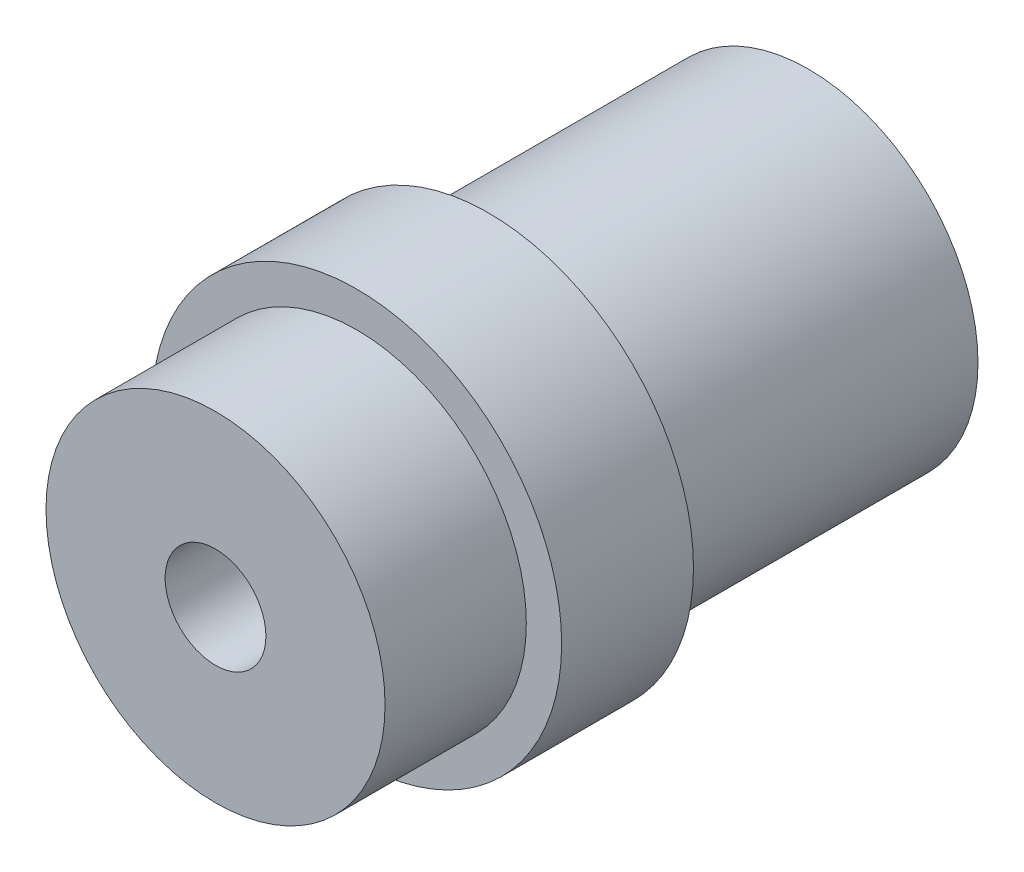
ISO-10303-21;
HEADER;
FILE_DESCRIPTION(('STEP AP214'),'2;1');
FILE_NAME('part.step','',(''),(''),'','','');
FILE_SCHEMA(('AUTOMOTIVE_DESIGN { 1 0 10303 214 1 1 1 1 }'));
ENDSEC;
DATA;
#1=APPLICATION_CONTEXT('core data for automotive mechanical design processes');
#2=APPLICATION_PROTOCOL_DEFINITION('international standard','automotive_design',2000,#1);
#3=PRODUCT_CONTEXT('',#1,'mechanical');
#4=PRODUCT('Part','Part','',(#3));
#5=PRODUCT_RELATED_PRODUCT_CATEGORY('part','',(#4));
#6=PRODUCT_DEFINITION_FORMATION('','',#4);
#7=PRODUCT_DEFINITION_CONTEXT('part definition',#1,'design');
#8=PRODUCT_DEFINITION('design','',#6,#7);
#9=PRODUCT_DEFINITION_SHAPE('','',#8);
#10=(LENGTH_UNIT() NAMED_UNIT(*) SI_UNIT(.MILLI.,.METRE.));
#11=(NAMED_UNIT(*) PLANE_ANGLE_UNIT() SI_UNIT($,.RADIAN.));
#12=(NAMED_UNIT(*) SI_UNIT($,.STERADIAN.) SOLID_ANGLE_UNIT());
#13=UNCERTAINTY_MEASURE_WITH_UNIT(LENGTH_MEASURE(1.E-05),#10,'distance_accuracy_value','');
#14=(GEOMETRIC_REPRESENTATION_CONTEXT(3) GLOBAL_UNCERTAINTY_ASSIGNED_CONTEXT((#13)) GLOBAL_UNIT_ASSIGNED_CONTEXT((#10,
#11,#12)) REPRESENTATION_CONTEXT('',''));
#15=CARTESIAN_POINT('',(0.,0.,0.));
#16=DIRECTION('',(0.,0.,1.));
#17=DIRECTION('',(1.,0.,0.));
#18=AXIS2_PLACEMENT_3D('',#15,#16,#17);
#19=CARTESIAN_POINT('',(0.,0.,0.));
#20=DIRECTION('',(0.,0.,1.));
#21=DIRECTION('',(1.,0.,0.));
#22=AXIS2_PLACEMENT_3D('',#19,#20,#21);
#23=PLANE('',#22);
#24=CARTESIAN_POINT('',(0.,0.,0.));
#25=DIRECTION('',(0.,0.,1.));
#26=DIRECTION('',(1.,0.,0.));
#27=AXIS2_PLACEMENT_3D('',#24,#25,#26);
#28=CIRCLE('',#27,9.);
#29=CARTESIAN_POINT('',(9.,0.,0.));
#30=VERTEX_POINT('',#29);
#31=EDGE_CURVE('E35',#30,#30,#28,.T.);
#32=ORIENTED_EDGE('',*,*,#31,.F.);
#33=EDGE_LOOP('',(#32));
#34=FACE_BOUND('',#33,.T.);
#35=CARTESIAN_POINT('',(0.,0.,0.));
#36=DIRECTION('',(0.,0.,1.));
#37=DIRECTION('',(1.,0.,0.));
#38=AXIS2_PLACEMENT_3D('',#35,#36,#37);
#39=CIRCLE('',#38,2.675);
#40=CARTESIAN_POINT('',(2.675,0.,0.));
#41=VERTEX_POINT('',#40);
#42=EDGE_CURVE('E51',#41,#41,#39,.T.);
#43=ORIENTED_EDGE('',*,*,#42,.T.);
#44=EDGE_LOOP('',(#43));
#45=FACE_BOUND('',#44,.T.);
#46=ADVANCED_FACE('F31',(#34,#45),#23,.F.);
#47=CARTESIAN_POINT('',(0.,0.,16.98));
#48=DIRECTION('',(0.,0.,-1.));
#49=DIRECTION('',(-1.,0.,0.));
#50=AXIS2_PLACEMENT_3D('',#47,#48,#49);
#51=CYLINDRICAL_SURFACE('',#50,9.);
#52=CARTESIAN_POINT('',(0.,0.,16.98));
#53=DIRECTION('',(0.,0.,1.));
#54=DIRECTION('',(1.,0.,0.));
#55=AXIS2_PLACEMENT_3D('',#52,#53,#54);
#56=CIRCLE('',#55,9.);
#57=CARTESIAN_POINT('',(9.,0.,16.98));
#58=VERTEX_POINT('',#57);
#59=EDGE_CURVE('E39',#58,#58,#56,.T.);
#60=ORIENTED_EDGE('',*,*,#59,.F.);
#61=EDGE_LOOP('',(#60));
#62=FACE_BOUND('',#61,.T.);
#63=ORIENTED_EDGE('',*,*,#31,.T.);
#64=EDGE_LOOP('',(#63));
#65=FACE_BOUND('',#64,.T.);
#66=ADVANCED_FACE('F33',(#62,#65),#51,.T.);
#67=CARTESIAN_POINT('',(0.,0.,16.98));
#68=DIRECTION('',(0.,0.,-1.));
#69=DIRECTION('',(-1.,0.,0.));
#70=AXIS2_PLACEMENT_3D('',#67,#68,#69);
#71=CYLINDRICAL_SURFACE('',#70,2.675);
#72=ORIENTED_EDGE('',*,*,#42,.F.);
#73=EDGE_LOOP('',(#72));
#74=FACE_BOUND('',#73,.T.);
#75=CARTESIAN_POINT('',(0.,0.,31.48));
#76=DIRECTION('',(0.,0.,1.));
#77=DIRECTION('',(1.,0.,0.));
#78=AXIS2_PLACEMENT_3D('',#75,#76,#77);
#79=CIRCLE('',#78,2.675);
#80=CARTESIAN_POINT('',(2.675,0.,31.48));
#81=VERTEX_POINT('',#80);
#82=EDGE_CURVE('E98',#81,#81,#79,.T.);
#83=ORIENTED_EDGE('',*,*,#82,.T.);
#84=EDGE_LOOP('',(#83));
#85=FACE_BOUND('',#84,.T.);
#86=ADVANCED_FACE('F66',(#74,#85),#71,.F.);
#87=CARTESIAN_POINT('',(0.,0.,23.98));
#88=DIRECTION('',(0.,0.,1.));
#89=DIRECTION('',(1.,0.,0.));
#90=AXIS2_PLACEMENT_3D('',#87,#88,#89);
#91=PLANE('',#90);
#92=CARTESIAN_POINT('',(0.,0.,23.98));
#93=DIRECTION('',(0.,0.,1.));
#94=DIRECTION('',(1.,0.,0.));
#95=AXIS2_PLACEMENT_3D('',#92,#93,#94);
#96=CIRCLE('',#95,9.);
#97=CARTESIAN_POINT('',(9.,0.,23.98));
#98=VERTEX_POINT('',#97);
#99=EDGE_CURVE('E10',#98,#98,#96,.T.);
#100=ORIENTED_EDGE('',*,*,#99,.F.);
#101=EDGE_LOOP('',(#100));
#102=FACE_BOUND('',#101,.T.);
#103=CARTESIAN_POINT('',(0.,0.,23.98));
#104=DIRECTION('',(0.,0.,1.));
#105=DIRECTION('',(1.,0.,0.));
#106=AXIS2_PLACEMENT_3D('',#103,#104,#105);
#107=CIRCLE('',#106,10.875);
#108=CARTESIAN_POINT('',(10.875,0.,23.98));
#109=VERTEX_POINT('',#108);
#110=EDGE_CURVE('E48',#109,#109,#107,.T.);
#111=ORIENTED_EDGE('',*,*,#110,.T.);
#112=EDGE_LOOP('',(#111));
#113=FACE_BOUND('',#112,.T.);
#114=ADVANCED_FACE('F71',(#102,#113),#91,.T.);
#115=CARTESIAN_POINT('',(0.,0.,16.98));
#116=DIRECTION('',(0.,0.,1.));
#117=DIRECTION('',(1.,0.,0.));
#118=AXIS2_PLACEMENT_3D('',#115,#116,#117);
#119=PLANE('',#118);
#120=ORIENTED_EDGE('',*,*,#59,.T.);
#121=EDGE_LOOP('',(#120));
#122=FACE_BOUND('',#121,.T.);
#123=CARTESIAN_POINT('',(0.,0.,16.98));
#124=DIRECTION('',(0.,0.,1.));
#125=DIRECTION('',(1.,0.,0.));
#126=AXIS2_PLACEMENT_3D('',#123,#124,#125);
#127=CIRCLE('',#126,10.875);
#128=CARTESIAN_POINT('',(10.875,0.,16.98));
#129=VERTEX_POINT('',#128);
#130=EDGE_CURVE('E52',#129,#129,#127,.T.);
#131=ORIENTED_EDGE('',*,*,#130,.F.);
#132=EDGE_LOOP('',(#131));
#133=FACE_BOUND('',#132,.T.);
#134=ADVANCED_FACE('F77',(#122,#133),#119,.F.);
#135=CARTESIAN_POINT('',(0.,0.,23.98));
#136=DIRECTION('',(0.,0.,-1.));
#137=DIRECTION('',(-1.,0.,0.));
#138=AXIS2_PLACEMENT_3D('',#135,#136,#137);
#139=CYLINDRICAL_SURFACE('',#138,10.875);
#140=ORIENTED_EDGE('',*,*,#110,.F.);
#141=EDGE_LOOP('',(#140));
#142=FACE_BOUND('',#141,.T.);
#143=ORIENTED_EDGE('',*,*,#130,.T.);
#144=EDGE_LOOP('',(#143));
#145=FACE_BOUND('',#144,.T.);
#146=ADVANCED_FACE('F73',(#142,#145),#139,.T.);
#147=CARTESIAN_POINT('',(0.,0.,31.48));
#148=DIRECTION('',(0.,0.,1.));
#149=DIRECTION('',(1.,0.,0.));
#150=AXIS2_PLACEMENT_3D('',#147,#148,#149);
#151=PLANE('',#150);
#152=CARTESIAN_POINT('',(0.,0.,31.48));
#153=DIRECTION('',(0.,0.,1.));
#154=DIRECTION('',(1.,0.,0.));
#155=AXIS2_PLACEMENT_3D('',#152,#153,#154);
#156=CIRCLE('',#155,9.);
#157=CARTESIAN_POINT('',(9.,0.,31.48));
#158=VERTEX_POINT('',#157);
#159=EDGE_CURVE('E46',#158,#158,#156,.T.);
#160=ORIENTED_EDGE('',*,*,#159,.T.);
#161=EDGE_LOOP('',(#160));
#162=FACE_BOUND('',#161,.T.);
#163=ORIENTED_EDGE('',*,*,#82,.F.);
#164=EDGE_LOOP('',(#163));
#165=FACE_BOUND('',#164,.T.);
#166=ADVANCED_FACE('F76',(#162,#165),#151,.T.);
#167=CARTESIAN_POINT('',(0.,0.,31.48));
#168=DIRECTION('',(0.,0.,-1.));
#169=DIRECTION('',(-1.,0.,0.));
#170=AXIS2_PLACEMENT_3D('',#167,#168,#169);
#171=CYLINDRICAL_SURFACE('',#170,9.);
#172=ORIENTED_EDGE('',*,*,#159,.F.);
#173=EDGE_LOOP('',(#172));
#174=FACE_BOUND('',#173,.T.);
#175=ORIENTED_EDGE('',*,*,#99,.T.);
#176=EDGE_LOOP('',(#175));
#177=FACE_BOUND('',#176,.T.);
#178=ADVANCED_FACE('F85',(#174,#177),#171,.T.);
#179=CLOSED_SHELL('',(#46,#66,#86,#114,#134,#146,#166,#178));
#180=MANIFOLD_SOLID_BREP('B2',#179);
#181=ADVANCED_BREP_SHAPE_REPRESENTATION('',(#18,#180),#14);
#182=SHAPE_DEFINITION_REPRESENTATION(#9,#181);
ENDSEC;
END-ISO-10303-21;
